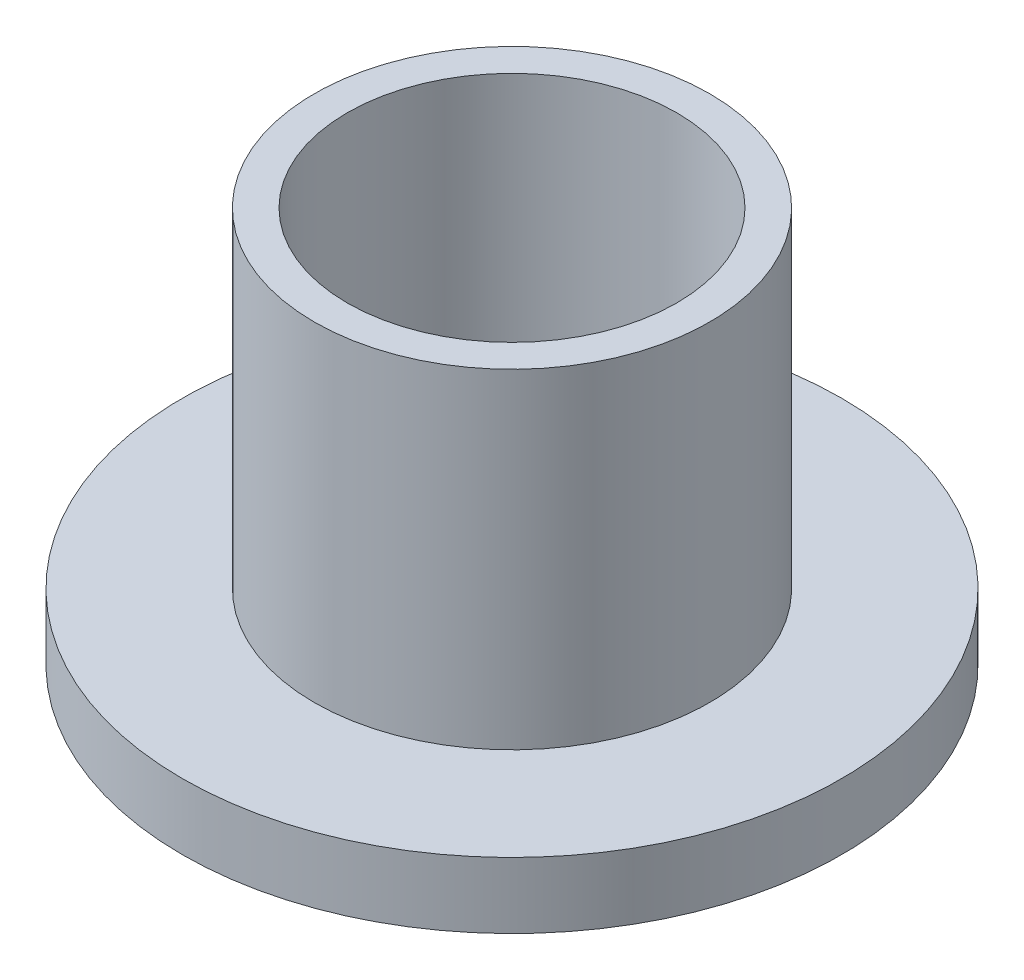
ISO-10303-21;
HEADER;
FILE_DESCRIPTION(('STEP AP214'),'2;1');
FILE_NAME('part.step','',(''),(''),'','','');
FILE_SCHEMA(('AUTOMOTIVE_DESIGN { 1 0 10303 214 1 1 1 1 }'));
ENDSEC;
DATA;
#1=APPLICATION_CONTEXT('core data for automotive mechanical design processes');
#2=APPLICATION_PROTOCOL_DEFINITION('international standard','automotive_design',2000,#1);
#3=PRODUCT_CONTEXT('',#1,'mechanical');
#4=PRODUCT('Part','Part','',(#3));
#5=PRODUCT_RELATED_PRODUCT_CATEGORY('part','',(#4));
#6=PRODUCT_DEFINITION_FORMATION('','',#4);
#7=PRODUCT_DEFINITION_CONTEXT('part definition',#1,'design');
#8=PRODUCT_DEFINITION('design','',#6,#7);
#9=PRODUCT_DEFINITION_SHAPE('','',#8);
#10=(LENGTH_UNIT() NAMED_UNIT(*) SI_UNIT(.MILLI.,.METRE.));
#11=(NAMED_UNIT(*) PLANE_ANGLE_UNIT() SI_UNIT($,.RADIAN.));
#12=(NAMED_UNIT(*) SI_UNIT($,.STERADIAN.) SOLID_ANGLE_UNIT());
#13=UNCERTAINTY_MEASURE_WITH_UNIT(LENGTH_MEASURE(1.E-05),#10,'distance_accuracy_value','');
#14=(GEOMETRIC_REPRESENTATION_CONTEXT(3) GLOBAL_UNCERTAINTY_ASSIGNED_CONTEXT((#13)) GLOBAL_UNIT_ASSIGNED_CONTEXT((#10,
#11,#12)) REPRESENTATION_CONTEXT('',''));
#15=CARTESIAN_POINT('',(0.,0.,0.));
#16=DIRECTION('',(0.,0.,1.));
#17=DIRECTION('',(1.,0.,0.));
#18=AXIS2_PLACEMENT_3D('',#15,#16,#17);
#19=CARTESIAN_POINT('',(0.,2.,0.));
#20=DIRECTION('',(0.,-1.,0.));
#21=DIRECTION('',(0.,0.,-1.));
#22=AXIS2_PLACEMENT_3D('',#19,#20,#21);
#23=CYLINDRICAL_SURFACE('',#22,10.);
#24=CARTESIAN_POINT('',(0.,2.,0.));
#25=DIRECTION('',(0.,1.,0.));
#26=DIRECTION('',(0.,0.,1.));
#27=AXIS2_PLACEMENT_3D('',#24,#25,#26);
#28=CIRCLE('',#27,10.);
#29=CARTESIAN_POINT('',(0.,2.,10.));
#30=VERTEX_POINT('',#29);
#31=EDGE_CURVE('E40',#30,#30,#28,.T.);
#32=ORIENTED_EDGE('',*,*,#31,.F.);
#33=EDGE_LOOP('',(#32));
#34=FACE_BOUND('',#33,.T.);
#35=CARTESIAN_POINT('',(0.,0.,0.));
#36=DIRECTION('',(0.,1.,0.));
#37=DIRECTION('',(0.,0.,1.));
#38=AXIS2_PLACEMENT_3D('',#35,#36,#37);
#39=CIRCLE('',#38,10.);
#40=CARTESIAN_POINT('',(0.,0.,10.));
#41=VERTEX_POINT('',#40);
#42=EDGE_CURVE('E36',#41,#41,#39,.T.);
#43=ORIENTED_EDGE('',*,*,#42,.T.);
#44=EDGE_LOOP('',(#43));
#45=FACE_BOUND('',#44,.T.);
#46=ADVANCED_FACE('F33',(#34,#45),#23,.T.);
#47=CARTESIAN_POINT('',(0.,2.,0.));
#48=DIRECTION('',(0.,1.,0.));
#49=DIRECTION('',(0.,0.,1.));
#50=AXIS2_PLACEMENT_3D('',#47,#48,#49);
#51=PLANE('',#50);
#52=CARTESIAN_POINT('',(0.,2.,0.));
#53=DIRECTION('',(0.,1.,0.));
#54=DIRECTION('',(0.,0.,1.));
#55=AXIS2_PLACEMENT_3D('',#52,#53,#54);
#56=CIRCLE('',#55,6.);
#57=CARTESIAN_POINT('',(0.,2.,6.));
#58=VERTEX_POINT('',#57);
#59=EDGE_CURVE('E10',#58,#58,#56,.T.);
#60=ORIENTED_EDGE('',*,*,#59,.F.);
#61=EDGE_LOOP('',(#60));
#62=FACE_BOUND('',#61,.T.);
#63=ORIENTED_EDGE('',*,*,#31,.T.);
#64=EDGE_LOOP('',(#63));
#65=FACE_BOUND('',#64,.T.);
#66=ADVANCED_FACE('F72',(#62,#65),#51,.T.);
#67=CARTESIAN_POINT('',(0.,0.,0.));
#68=DIRECTION('',(0.,1.,0.));
#69=DIRECTION('',(0.,0.,1.));
#70=AXIS2_PLACEMENT_3D('',#67,#68,#69);
#71=PLANE('',#70);
#72=CARTESIAN_POINT('',(0.,0.,0.));
#73=DIRECTION('',(0.,1.,0.));
#74=DIRECTION('',(0.,0.,1.));
#75=AXIS2_PLACEMENT_3D('',#72,#73,#74);
#76=CIRCLE('',#75,5.);
#77=CARTESIAN_POINT('',(0.,0.,5.));
#78=VERTEX_POINT('',#77);
#79=EDGE_CURVE('E49',#78,#78,#76,.T.);
#80=ORIENTED_EDGE('',*,*,#79,.T.);
#81=EDGE_LOOP('',(#80));
#82=FACE_BOUND('',#81,.T.);
#83=ORIENTED_EDGE('',*,*,#42,.F.);
#84=EDGE_LOOP('',(#83));
#85=FACE_BOUND('',#84,.T.);
#86=ADVANCED_FACE('F67',(#82,#85),#71,.F.);
#87=CARTESIAN_POINT('',(0.,12.,0.));
#88=DIRECTION('',(0.,-1.,0.));
#89=DIRECTION('',(0.,0.,-1.));
#90=AXIS2_PLACEMENT_3D('',#87,#88,#89);
#91=CYLINDRICAL_SURFACE('',#90,6.);
#92=CARTESIAN_POINT('',(0.,12.,0.));
#93=DIRECTION('',(0.,1.,0.));
#94=DIRECTION('',(0.,0.,1.));
#95=AXIS2_PLACEMENT_3D('',#92,#93,#94);
#96=CIRCLE('',#95,6.);
#97=CARTESIAN_POINT('',(0.,12.,6.));
#98=VERTEX_POINT('',#97);
#99=EDGE_CURVE('E46',#98,#98,#96,.T.);
#100=ORIENTED_EDGE('',*,*,#99,.F.);
#101=EDGE_LOOP('',(#100));
#102=FACE_BOUND('',#101,.T.);
#103=ORIENTED_EDGE('',*,*,#59,.T.);
#104=EDGE_LOOP('',(#103));
#105=FACE_BOUND('',#104,.T.);
#106=ADVANCED_FACE('F62',(#102,#105),#91,.T.);
#107=CARTESIAN_POINT('',(0.,12.,0.));
#108=DIRECTION('',(0.,1.,0.));
#109=DIRECTION('',(0.,0.,1.));
#110=AXIS2_PLACEMENT_3D('',#107,#108,#109);
#111=PLANE('',#110);
#112=CARTESIAN_POINT('',(0.,12.,0.));
#113=DIRECTION('',(0.,1.,0.));
#114=DIRECTION('',(0.,0.,1.));
#115=AXIS2_PLACEMENT_3D('',#112,#113,#114);
#116=CIRCLE('',#115,5.);
#117=CARTESIAN_POINT('',(0.,12.,5.));
#118=VERTEX_POINT('',#117);
#119=EDGE_CURVE('E52',#118,#118,#116,.T.);
#120=ORIENTED_EDGE('',*,*,#119,.F.);
#121=EDGE_LOOP('',(#120));
#122=FACE_BOUND('',#121,.T.);
#123=ORIENTED_EDGE('',*,*,#99,.T.);
#124=EDGE_LOOP('',(#123));
#125=FACE_BOUND('',#124,.T.);
#126=ADVANCED_FACE('F59',(#122,#125),#111,.T.);
#127=CARTESIAN_POINT('',(0.,-15.,0.));
#128=DIRECTION('',(0.,1.,0.));
#129=DIRECTION('',(0.,0.,1.));
#130=AXIS2_PLACEMENT_3D('',#127,#128,#129);
#131=CYLINDRICAL_SURFACE('',#130,5.);
#132=ORIENTED_EDGE('',*,*,#119,.T.);
#133=EDGE_LOOP('',(#132));
#134=FACE_BOUND('',#133,.T.);
#135=ORIENTED_EDGE('',*,*,#79,.F.);
#136=EDGE_LOOP('',(#135));
#137=FACE_BOUND('',#136,.T.);
#138=ADVANCED_FACE('F56',(#134,#137),#131,.F.);
#139=CLOSED_SHELL('',(#46,#66,#86,#106,#126,#138));
#140=MANIFOLD_SOLID_BREP('B2',#139);
#141=ADVANCED_BREP_SHAPE_REPRESENTATION('',(#18,#140),#14);
#142=SHAPE_DEFINITION_REPRESENTATION(#9,#141);
ENDSEC;
END-ISO-10303-21;
